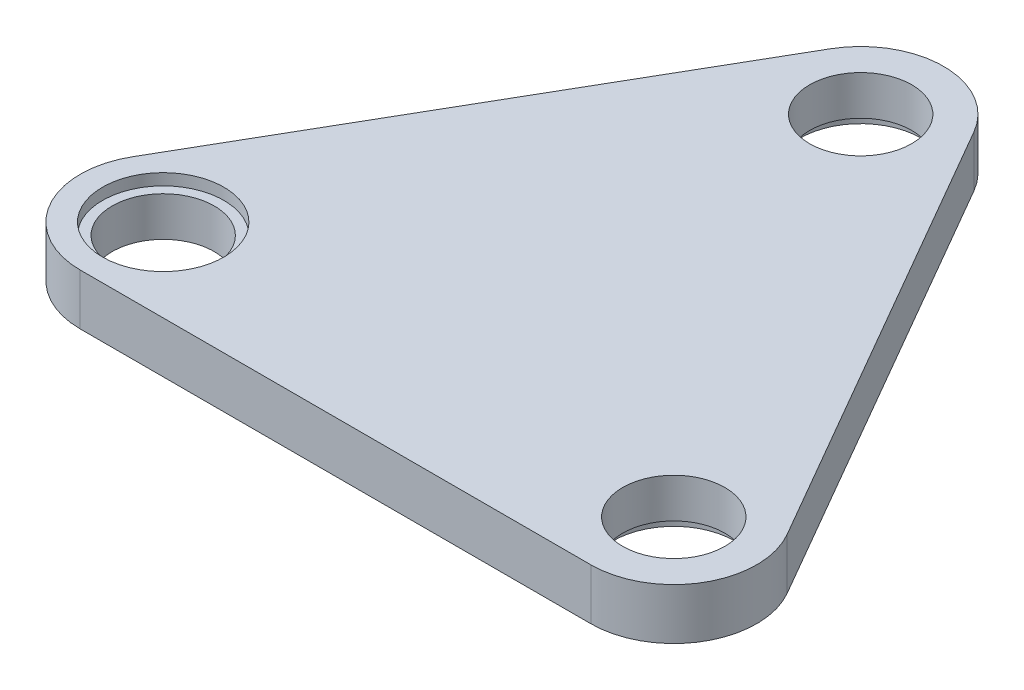
ISO-10303-21;
HEADER;
FILE_DESCRIPTION(('STEP AP214'),'2;1');
FILE_NAME('part.step','',(''),(''),'','','');
FILE_SCHEMA(('AUTOMOTIVE_DESIGN { 1 0 10303 214 1 1 1 1 }'));
ENDSEC;
DATA;
#1=APPLICATION_CONTEXT('core data for automotive mechanical design processes');
#2=APPLICATION_PROTOCOL_DEFINITION('international standard','automotive_design',2000,#1);
#3=PRODUCT_CONTEXT('',#1,'mechanical');
#4=PRODUCT('Part','Part','',(#3));
#5=PRODUCT_RELATED_PRODUCT_CATEGORY('part','',(#4));
#6=PRODUCT_DEFINITION_FORMATION('','',#4);
#7=PRODUCT_DEFINITION_CONTEXT('part definition',#1,'design');
#8=PRODUCT_DEFINITION('design','',#6,#7);
#9=PRODUCT_DEFINITION_SHAPE('','',#8);
#10=(LENGTH_UNIT() NAMED_UNIT(*) SI_UNIT(.MILLI.,.METRE.));
#11=(NAMED_UNIT(*) PLANE_ANGLE_UNIT() SI_UNIT($,.RADIAN.));
#12=(NAMED_UNIT(*) SI_UNIT($,.STERADIAN.) SOLID_ANGLE_UNIT());
#13=UNCERTAINTY_MEASURE_WITH_UNIT(LENGTH_MEASURE(1.E-05),#10,'distance_accuracy_value','');
#14=(GEOMETRIC_REPRESENTATION_CONTEXT(3) GLOBAL_UNCERTAINTY_ASSIGNED_CONTEXT((#13)) GLOBAL_UNIT_ASSIGNED_CONTEXT((#10,
#11,#12)) REPRESENTATION_CONTEXT('',''));
#15=CARTESIAN_POINT('',(0.,0.,0.));
#16=DIRECTION('',(0.,0.,1.));
#17=DIRECTION('',(1.,0.,0.));
#18=AXIS2_PLACEMENT_3D('',#15,#16,#17);
#19=CARTESIAN_POINT('',(-5.62916512459886,4.,-3.24999999999999));
#20=DIRECTION('',(-0.86602540378444,0.,-0.499999999999998));
#21=DIRECTION('',(-0.499999999999998,0.,0.86602540378444));
#22=AXIS2_PLACEMENT_3D('',#19,#20,#21);
#23=PLANE('',#22);
#24=DIRECTION('',(0.499999999999998,0.,-0.86602540378444));
#25=VECTOR('',#24,1.);
#26=CARTESIAN_POINT('',(-5.62916512459886,0.,-3.24999999999999));
#27=LINE('',#26,#25);
#28=CARTESIAN_POINT('',(-5.62916512459886,0.,-3.24999999999999));
#29=VERTEX_POINT('',#28);
#30=CARTESIAN_POINT('',(14.370834875401,0.,-37.8910161513776));
#31=VERTEX_POINT('',#30);
#32=EDGE_CURVE('E127',#29,#31,#27,.T.);
#33=ORIENTED_EDGE('',*,*,#32,.F.);
#34=DIRECTION('',(0.,-1.,0.));
#35=VECTOR('',#34,1.);
#36=CARTESIAN_POINT('',(-5.62916512459886,4.,-3.24999999999999));
#37=LINE('',#36,#35);
#38=CARTESIAN_POINT('',(-5.62916512459886,4.,-3.24999999999999));
#39=VERTEX_POINT('',#38);
#40=EDGE_CURVE('E11',#39,#29,#37,.T.);
#41=ORIENTED_EDGE('',*,*,#40,.F.);
#42=DIRECTION('',(0.499999999999998,0.,-0.86602540378444));
#43=VECTOR('',#42,1.);
#44=CARTESIAN_POINT('',(-5.62916512459886,4.,-3.24999999999999));
#45=LINE('',#44,#43);
#46=CARTESIAN_POINT('',(14.370834875401,4.,-37.8910161513776));
#47=VERTEX_POINT('',#46);
#48=EDGE_CURVE('E140',#39,#47,#45,.T.);
#49=ORIENTED_EDGE('',*,*,#48,.T.);
#50=DIRECTION('',(0.,-1.,0.));
#51=VECTOR('',#50,1.);
#52=CARTESIAN_POINT('',(14.370834875401,4.,-37.8910161513776));
#53=LINE('',#52,#51);
#54=EDGE_CURVE('E89',#47,#31,#53,.T.);
#55=ORIENTED_EDGE('',*,*,#54,.T.);
#56=EDGE_LOOP('',(#33,#41,#49,#55));
#57=FACE_BOUND('',#56,.T.);
#58=ADVANCED_FACE('F43',(#57),#23,.T.);
#59=CARTESIAN_POINT('',(0.,4.,0.));
#60=DIRECTION('',(0.,-1.,0.));
#61=DIRECTION('',(0.,0.,-1.));
#62=AXIS2_PLACEMENT_3D('',#59,#60,#61);
#63=CYLINDRICAL_SURFACE('',#62,6.5);
#64=CARTESIAN_POINT('',(0.,0.,0.));
#65=DIRECTION('',(0.,1.,0.));
#66=DIRECTION('',(0.,0.,1.));
#67=AXIS2_PLACEMENT_3D('',#64,#65,#66);
#68=CIRCLE('',#67,6.5);
#69=CARTESIAN_POINT('',(0.,0.,6.5));
#70=VERTEX_POINT('',#69);
#71=EDGE_CURVE('E130',#29,#70,#68,.T.);
#72=ORIENTED_EDGE('',*,*,#71,.T.);
#73=DIRECTION('',(0.,-1.,0.));
#74=VECTOR('',#73,1.);
#75=CARTESIAN_POINT('',(0.,4.,6.5));
#76=LINE('',#75,#74);
#77=CARTESIAN_POINT('',(0.,4.,6.5));
#78=VERTEX_POINT('',#77);
#79=EDGE_CURVE('E52',#78,#70,#76,.T.);
#80=ORIENTED_EDGE('',*,*,#79,.F.);
#81=CARTESIAN_POINT('',(0.,4.,0.));
#82=DIRECTION('',(0.,1.,0.));
#83=DIRECTION('',(0.,0.,1.));
#84=AXIS2_PLACEMENT_3D('',#81,#82,#83);
#85=CIRCLE('',#84,6.5);
#86=EDGE_CURVE('E172',#39,#78,#85,.T.);
#87=ORIENTED_EDGE('',*,*,#86,.F.);
#88=ORIENTED_EDGE('',*,*,#40,.T.);
#89=EDGE_LOOP('',(#72,#80,#87,#88));
#90=FACE_BOUND('',#89,.T.);
#91=ADVANCED_FACE('F175',(#90),#63,.T.);
#92=CARTESIAN_POINT('',(0.,4.,6.5));
#93=DIRECTION('',(0.,0.,-1.));
#94=DIRECTION('',(-1.,0.,0.));
#95=AXIS2_PLACEMENT_3D('',#92,#93,#94);
#96=PLANE('',#95);
#97=DIRECTION('',(1.,0.,0.));
#98=VECTOR('',#97,1.);
#99=CARTESIAN_POINT('',(0.,0.,6.5));
#100=LINE('',#99,#98);
#101=CARTESIAN_POINT('',(40.,0.,6.5));
#102=VERTEX_POINT('',#101);
#103=EDGE_CURVE('E133',#70,#102,#100,.T.);
#104=ORIENTED_EDGE('',*,*,#103,.T.);
#105=DIRECTION('',(0.,-1.,0.));
#106=VECTOR('',#105,1.);
#107=CARTESIAN_POINT('',(40.,4.,6.5));
#108=LINE('',#107,#106);
#109=CARTESIAN_POINT('',(40.,4.,6.5));
#110=VERTEX_POINT('',#109);
#111=EDGE_CURVE('E120',#110,#102,#108,.T.);
#112=ORIENTED_EDGE('',*,*,#111,.F.);
#113=DIRECTION('',(1.,0.,0.));
#114=VECTOR('',#113,1.);
#115=CARTESIAN_POINT('',(0.,4.,6.5));
#116=LINE('',#115,#114);
#117=EDGE_CURVE('E107',#78,#110,#116,.T.);
#118=ORIENTED_EDGE('',*,*,#117,.F.);
#119=ORIENTED_EDGE('',*,*,#79,.T.);
#120=EDGE_LOOP('',(#104,#112,#118,#119));
#121=FACE_BOUND('',#120,.T.);
#122=ADVANCED_FACE('F179',(#121),#96,.F.);
#123=CARTESIAN_POINT('',(40.,4.,0.));
#124=DIRECTION('',(0.,-1.,0.));
#125=DIRECTION('',(0.,0.,-1.));
#126=AXIS2_PLACEMENT_3D('',#123,#124,#125);
#127=CYLINDRICAL_SURFACE('',#126,6.5);
#128=CARTESIAN_POINT('',(40.,0.,0.));
#129=DIRECTION('',(0.,1.,0.));
#130=DIRECTION('',(0.,0.,1.));
#131=AXIS2_PLACEMENT_3D('',#128,#129,#130);
#132=CIRCLE('',#131,6.5);
#133=CARTESIAN_POINT('',(45.6291651245988,0.,-3.25000000000001));
#134=VERTEX_POINT('',#133);
#135=EDGE_CURVE('E116',#102,#134,#132,.T.);
#136=ORIENTED_EDGE('',*,*,#135,.T.);
#137=DIRECTION('',(0.,-1.,0.));
#138=VECTOR('',#137,1.);
#139=CARTESIAN_POINT('',(45.6291651245988,4.,-3.25000000000001));
#140=LINE('',#139,#138);
#141=CARTESIAN_POINT('',(45.6291651245988,4.,-3.25000000000001));
#142=VERTEX_POINT('',#141);
#143=EDGE_CURVE('E113',#142,#134,#140,.T.);
#144=ORIENTED_EDGE('',*,*,#143,.F.);
#145=CARTESIAN_POINT('',(40.,4.,0.));
#146=DIRECTION('',(0.,1.,0.));
#147=DIRECTION('',(0.,0.,1.));
#148=AXIS2_PLACEMENT_3D('',#145,#146,#147);
#149=CIRCLE('',#148,6.5);
#150=EDGE_CURVE('E101',#110,#142,#149,.T.);
#151=ORIENTED_EDGE('',*,*,#150,.F.);
#152=ORIENTED_EDGE('',*,*,#111,.T.);
#153=EDGE_LOOP('',(#136,#144,#151,#152));
#154=FACE_BOUND('',#153,.T.);
#155=ADVANCED_FACE('F114',(#154),#127,.T.);
#156=CARTESIAN_POINT('',(35.6291651245988,4.,-20.5705080756888));
#157=DIRECTION('',(0.866025403784438,0.,-0.500000000000001));
#158=DIRECTION('',(-0.500000000000001,0.,-0.866025403784438));
#159=AXIS2_PLACEMENT_3D('',#156,#157,#158);
#160=PLANE('',#159);
#161=DIRECTION('',(0.500000000000001,0.,0.866025403784438));
#162=VECTOR('',#161,1.);
#163=CARTESIAN_POINT('',(35.6291651245988,0.,-20.5705080756888));
#164=LINE('',#163,#162);
#165=CARTESIAN_POINT('',(25.6291651245988,0.,-37.8910161513776));
#166=VERTEX_POINT('',#165);
#167=EDGE_CURVE('E136',#166,#134,#164,.T.);
#168=ORIENTED_EDGE('',*,*,#167,.F.);
#169=DIRECTION('',(0.,-1.,0.));
#170=VECTOR('',#169,1.);
#171=CARTESIAN_POINT('',(25.6291651245988,4.,-37.8910161513776));
#172=LINE('',#171,#170);
#173=CARTESIAN_POINT('',(25.6291651245988,4.,-37.8910161513776));
#174=VERTEX_POINT('',#173);
#175=EDGE_CURVE('E82',#174,#166,#172,.T.);
#176=ORIENTED_EDGE('',*,*,#175,.F.);
#177=DIRECTION('',(0.500000000000001,0.,0.866025403784438));
#178=VECTOR('',#177,1.);
#179=CARTESIAN_POINT('',(35.6291651245988,4.,-20.5705080756888));
#180=LINE('',#179,#178);
#181=EDGE_CURVE('E105',#174,#142,#180,.T.);
#182=ORIENTED_EDGE('',*,*,#181,.T.);
#183=ORIENTED_EDGE('',*,*,#143,.T.);
#184=EDGE_LOOP('',(#168,#176,#182,#183));
#185=FACE_BOUND('',#184,.T.);
#186=ADVANCED_FACE('F122',(#185),#160,.T.);
#187=CARTESIAN_POINT('',(19.9999999999999,4.,-34.6410161513776));
#188=DIRECTION('',(0.,-1.,0.));
#189=DIRECTION('',(0.,0.,-1.));
#190=AXIS2_PLACEMENT_3D('',#187,#188,#189);
#191=CYLINDRICAL_SURFACE('',#190,6.50000000000001);
#192=CARTESIAN_POINT('',(19.9999999999999,0.,-34.6410161513776));
#193=DIRECTION('',(0.,1.,0.));
#194=DIRECTION('',(0.,0.,1.));
#195=AXIS2_PLACEMENT_3D('',#192,#193,#194);
#196=CIRCLE('',#195,6.50000000000001);
#197=EDGE_CURVE('E138',#166,#31,#196,.T.);
#198=ORIENTED_EDGE('',*,*,#197,.T.);
#199=ORIENTED_EDGE('',*,*,#54,.F.);
#200=CARTESIAN_POINT('',(19.9999999999999,4.,-34.6410161513776));
#201=DIRECTION('',(0.,1.,0.));
#202=DIRECTION('',(0.,0.,1.));
#203=AXIS2_PLACEMENT_3D('',#200,#201,#202);
#204=CIRCLE('',#203,6.50000000000001);
#205=EDGE_CURVE('E61',#174,#47,#204,.T.);
#206=ORIENTED_EDGE('',*,*,#205,.F.);
#207=ORIENTED_EDGE('',*,*,#175,.T.);
#208=EDGE_LOOP('',(#198,#199,#206,#207));
#209=FACE_BOUND('',#208,.T.);
#210=ADVANCED_FACE('F182',(#209),#191,.T.);
#211=CARTESIAN_POINT('',(0.,4.,0.));
#212=DIRECTION('',(0.,1.,0.));
#213=DIRECTION('',(0.,0.,1.));
#214=AXIS2_PLACEMENT_3D('',#211,#212,#213);
#215=PLANE('',#214);
#216=CARTESIAN_POINT('',(40.,4.,0.));
#217=DIRECTION('',(0.,1.,0.));
#218=DIRECTION('',(0.,0.,1.));
#219=AXIS2_PLACEMENT_3D('',#216,#217,#218);
#220=CIRCLE('',#219,4.);
#221=CARTESIAN_POINT('',(40.,4.,4.));
#222=VERTEX_POINT('',#221);
#223=EDGE_CURVE('E46',#222,#222,#220,.T.);
#224=ORIENTED_EDGE('',*,*,#223,.F.);
#225=EDGE_LOOP('',(#224));
#226=FACE_BOUND('',#225,.T.);
#227=CARTESIAN_POINT('',(19.9999999999999,4.,-34.6410161513776));
#228=DIRECTION('',(0.,1.,0.));
#229=DIRECTION('',(0.,0.,1.));
#230=AXIS2_PLACEMENT_3D('',#227,#228,#229);
#231=CIRCLE('',#230,4.);
#232=CARTESIAN_POINT('',(19.9999999999999,4.,-30.6410161513776));
#233=VERTEX_POINT('',#232);
#234=EDGE_CURVE('E148',#233,#233,#231,.T.);
#235=ORIENTED_EDGE('',*,*,#234,.F.);
#236=EDGE_LOOP('',(#235));
#237=FACE_BOUND('',#236,.T.);
#238=CARTESIAN_POINT('',(0.,4.,0.));
#239=DIRECTION('',(0.,1.,0.));
#240=DIRECTION('',(0.,0.,1.));
#241=AXIS2_PLACEMENT_3D('',#238,#239,#240);
#242=CIRCLE('',#241,4.75);
#243=CARTESIAN_POINT('',(0.,4.,4.75));
#244=VERTEX_POINT('',#243);
#245=EDGE_CURVE('E150',#244,#244,#242,.T.);
#246=ORIENTED_EDGE('',*,*,#245,.F.);
#247=EDGE_LOOP('',(#246));
#248=FACE_BOUND('',#247,.T.);
#249=ORIENTED_EDGE('',*,*,#48,.F.);
#250=ORIENTED_EDGE('',*,*,#86,.T.);
#251=ORIENTED_EDGE('',*,*,#117,.T.);
#252=ORIENTED_EDGE('',*,*,#150,.T.);
#253=ORIENTED_EDGE('',*,*,#181,.F.);
#254=ORIENTED_EDGE('',*,*,#205,.T.);
#255=EDGE_LOOP('',(#249,#250,#251,#252,#253,#254));
#256=FACE_BOUND('',#255,.T.);
#257=ADVANCED_FACE('F103',(#226,#237,#248,#256),#215,.T.);
#258=CARTESIAN_POINT('',(0.,0.,0.));
#259=DIRECTION('',(0.,1.,0.));
#260=DIRECTION('',(0.,0.,1.));
#261=AXIS2_PLACEMENT_3D('',#258,#259,#260);
#262=PLANE('',#261);
#263=CARTESIAN_POINT('',(40.,0.,0.));
#264=DIRECTION('',(0.,-1.,0.));
#265=DIRECTION('',(0.,0.,-1.));
#266=AXIS2_PLACEMENT_3D('',#263,#264,#265);
#267=CIRCLE('',#266,4.75);
#268=CARTESIAN_POINT('',(40.,0.,-4.75));
#269=VERTEX_POINT('',#268);
#270=EDGE_CURVE('E246',#269,#269,#267,.T.);
#271=ORIENTED_EDGE('',*,*,#270,.F.);
#272=EDGE_LOOP('',(#271));
#273=FACE_BOUND('',#272,.T.);
#274=CARTESIAN_POINT('',(19.9999999999999,0.,-34.6410161513776));
#275=DIRECTION('',(0.,-1.,0.));
#276=DIRECTION('',(0.,0.,-1.));
#277=AXIS2_PLACEMENT_3D('',#274,#275,#276);
#278=CIRCLE('',#277,4.74999999999999);
#279=CARTESIAN_POINT('',(19.9999999999999,0.,-39.3910161513776));
#280=VERTEX_POINT('',#279);
#281=EDGE_CURVE('E163',#280,#280,#278,.T.);
#282=ORIENTED_EDGE('',*,*,#281,.F.);
#283=EDGE_LOOP('',(#282));
#284=FACE_BOUND('',#283,.T.);
#285=CARTESIAN_POINT('',(0.,0.,0.));
#286=DIRECTION('',(0.,1.,0.));
#287=DIRECTION('',(0.,0.,1.));
#288=AXIS2_PLACEMENT_3D('',#285,#286,#287);
#289=CIRCLE('',#288,4.);
#290=CARTESIAN_POINT('',(0.,0.,4.));
#291=VERTEX_POINT('',#290);
#292=EDGE_CURVE('E131',#291,#291,#289,.T.);
#293=ORIENTED_EDGE('',*,*,#292,.T.);
#294=EDGE_LOOP('',(#293));
#295=FACE_BOUND('',#294,.T.);
#296=ORIENTED_EDGE('',*,*,#32,.T.);
#297=ORIENTED_EDGE('',*,*,#197,.F.);
#298=ORIENTED_EDGE('',*,*,#167,.T.);
#299=ORIENTED_EDGE('',*,*,#135,.F.);
#300=ORIENTED_EDGE('',*,*,#103,.F.);
#301=ORIENTED_EDGE('',*,*,#71,.F.);
#302=EDGE_LOOP('',(#296,#297,#298,#299,#300,#301));
#303=FACE_BOUND('',#302,.T.);
#304=ADVANCED_FACE('F181',(#273,#284,#295,#303),#262,.F.);
#305=CARTESIAN_POINT('',(0.,4.,0.));
#306=DIRECTION('',(0.,1.,0.));
#307=DIRECTION('',(0.,0.,1.));
#308=AXIS2_PLACEMENT_3D('',#305,#306,#307);
#309=CYLINDRICAL_SURFACE('',#308,4.);
#310=CARTESIAN_POINT('',(0.,3.1,0.));
#311=DIRECTION('',(0.,1.,0.));
#312=DIRECTION('',(0.,0.,1.));
#313=AXIS2_PLACEMENT_3D('',#310,#311,#312);
#314=CIRCLE('',#313,4.);
#315=CARTESIAN_POINT('',(0.,3.1,4.));
#316=VERTEX_POINT('',#315);
#317=EDGE_CURVE('E147',#316,#316,#314,.T.);
#318=ORIENTED_EDGE('',*,*,#317,.T.);
#319=EDGE_LOOP('',(#318));
#320=FACE_BOUND('',#319,.T.);
#321=ORIENTED_EDGE('',*,*,#292,.F.);
#322=EDGE_LOOP('',(#321));
#323=FACE_BOUND('',#322,.T.);
#324=ADVANCED_FACE('F200',(#320,#323),#309,.F.);
#325=CARTESIAN_POINT('',(4.,3.1,0.));
#326=DIRECTION('',(0.,-1.,0.));
#327=DIRECTION('',(0.,0.,-1.));
#328=AXIS2_PLACEMENT_3D('',#325,#326,#327);
#329=PLANE('',#328);
#330=ORIENTED_EDGE('',*,*,#317,.F.);
#331=EDGE_LOOP('',(#330));
#332=FACE_BOUND('',#331,.T.);
#333=CARTESIAN_POINT('',(0.,3.1,0.));
#334=DIRECTION('',(0.,1.,0.));
#335=DIRECTION('',(0.,0.,1.));
#336=AXIS2_PLACEMENT_3D('',#333,#334,#335);
#337=CIRCLE('',#336,4.75);
#338=CARTESIAN_POINT('',(0.,3.1,4.75));
#339=VERTEX_POINT('',#338);
#340=EDGE_CURVE('E155',#339,#339,#337,.T.);
#341=ORIENTED_EDGE('',*,*,#340,.T.);
#342=EDGE_LOOP('',(#341));
#343=FACE_BOUND('',#342,.T.);
#344=ADVANCED_FACE('F207',(#332,#343),#329,.F.);
#345=CARTESIAN_POINT('',(0.,4.,0.));
#346=DIRECTION('',(0.,1.,0.));
#347=DIRECTION('',(0.,0.,1.));
#348=AXIS2_PLACEMENT_3D('',#345,#346,#347);
#349=CYLINDRICAL_SURFACE('',#348,4.75);
#350=ORIENTED_EDGE('',*,*,#340,.F.);
#351=EDGE_LOOP('',(#350));
#352=FACE_BOUND('',#351,.T.);
#353=ORIENTED_EDGE('',*,*,#245,.T.);
#354=EDGE_LOOP('',(#353));
#355=FACE_BOUND('',#354,.T.);
#356=ADVANCED_FACE('F211',(#352,#355),#349,.F.);
#357=CARTESIAN_POINT('',(19.9999999999999,0.,-34.6410161513776));
#358=DIRECTION('',(0.,-1.,0.));
#359=DIRECTION('',(0.,0.,-1.));
#360=AXIS2_PLACEMENT_3D('',#357,#358,#359);
#361=CYLINDRICAL_SURFACE('',#360,4.);
#362=ORIENTED_EDGE('',*,*,#234,.T.);
#363=EDGE_LOOP('',(#362));
#364=FACE_BOUND('',#363,.T.);
#365=CARTESIAN_POINT('',(19.9999999999999,0.899999999999998,-34.6410161513776));
#366=DIRECTION('',(0.,-1.,0.));
#367=DIRECTION('',(0.,0.,-1.));
#368=AXIS2_PLACEMENT_3D('',#365,#366,#367);
#369=CIRCLE('',#368,4.);
#370=CARTESIAN_POINT('',(19.9999999999999,0.899999999999998,-38.6410161513776));
#371=VERTEX_POINT('',#370);
#372=EDGE_CURVE('E151',#371,#371,#369,.T.);
#373=ORIENTED_EDGE('',*,*,#372,.T.);
#374=EDGE_LOOP('',(#373));
#375=FACE_BOUND('',#374,.T.);
#376=ADVANCED_FACE('F215',(#364,#375),#361,.F.);
#377=CARTESIAN_POINT('',(23.9999999999999,0.9,-34.6410161513776));
#378=DIRECTION('',(0.,1.,0.));
#379=DIRECTION('',(0.,0.,1.));
#380=AXIS2_PLACEMENT_3D('',#377,#378,#379);
#381=PLANE('',#380);
#382=ORIENTED_EDGE('',*,*,#372,.F.);
#383=EDGE_LOOP('',(#382));
#384=FACE_BOUND('',#383,.T.);
#385=CARTESIAN_POINT('',(19.9999999999999,0.900000000000001,-34.6410161513776));
#386=DIRECTION('',(0.,-1.,0.));
#387=DIRECTION('',(0.,0.,-1.));
#388=AXIS2_PLACEMENT_3D('',#385,#386,#387);
#389=CIRCLE('',#388,4.74999999999999);
#390=CARTESIAN_POINT('',(19.9999999999999,0.900000000000001,-39.3910161513776));
#391=VERTEX_POINT('',#390);
#392=EDGE_CURVE('E158',#391,#391,#389,.T.);
#393=ORIENTED_EDGE('',*,*,#392,.T.);
#394=EDGE_LOOP('',(#393));
#395=FACE_BOUND('',#394,.T.);
#396=ADVANCED_FACE('F219',(#384,#395),#381,.F.);
#397=CARTESIAN_POINT('',(19.9999999999999,0.,-34.6410161513776));
#398=DIRECTION('',(0.,-1.,0.));
#399=DIRECTION('',(0.,0.,-1.));
#400=AXIS2_PLACEMENT_3D('',#397,#398,#399);
#401=CYLINDRICAL_SURFACE('',#400,4.74999999999999);
#402=ORIENTED_EDGE('',*,*,#392,.F.);
#403=EDGE_LOOP('',(#402));
#404=FACE_BOUND('',#403,.T.);
#405=ORIENTED_EDGE('',*,*,#281,.T.);
#406=EDGE_LOOP('',(#405));
#407=FACE_BOUND('',#406,.T.);
#408=ADVANCED_FACE('F222',(#404,#407),#401,.F.);
#409=CARTESIAN_POINT('',(40.,0.,0.));
#410=DIRECTION('',(0.,-1.,0.));
#411=DIRECTION('',(0.,0.,-1.));
#412=AXIS2_PLACEMENT_3D('',#409,#410,#411);
#413=CYLINDRICAL_SURFACE('',#412,4.);
#414=ORIENTED_EDGE('',*,*,#223,.T.);
#415=EDGE_LOOP('',(#414));
#416=FACE_BOUND('',#415,.T.);
#417=CARTESIAN_POINT('',(40.,0.899999999999998,0.));
#418=DIRECTION('',(0.,-1.,0.));
#419=DIRECTION('',(0.,0.,-1.));
#420=AXIS2_PLACEMENT_3D('',#417,#418,#419);
#421=CIRCLE('',#420,4.);
#422=CARTESIAN_POINT('',(40.,0.899999999999998,-4.00000000000001));
#423=VERTEX_POINT('',#422);
#424=EDGE_CURVE('E248',#423,#423,#421,.T.);
#425=ORIENTED_EDGE('',*,*,#424,.T.);
#426=EDGE_LOOP('',(#425));
#427=FACE_BOUND('',#426,.T.);
#428=ADVANCED_FACE('F226',(#416,#427),#413,.F.);
#429=CARTESIAN_POINT('',(44.,0.9,0.));
#430=DIRECTION('',(0.,1.,0.));
#431=DIRECTION('',(0.,0.,1.));
#432=AXIS2_PLACEMENT_3D('',#429,#430,#431);
#433=PLANE('',#432);
#434=ORIENTED_EDGE('',*,*,#424,.F.);
#435=EDGE_LOOP('',(#434));
#436=FACE_BOUND('',#435,.T.);
#437=CARTESIAN_POINT('',(40.,0.900000000000001,0.));
#438=DIRECTION('',(0.,-1.,0.));
#439=DIRECTION('',(0.,0.,-1.));
#440=AXIS2_PLACEMENT_3D('',#437,#438,#439);
#441=CIRCLE('',#440,4.75);
#442=CARTESIAN_POINT('',(40.,0.900000000000001,-4.75));
#443=VERTEX_POINT('',#442);
#444=EDGE_CURVE('E243',#443,#443,#441,.T.);
#445=ORIENTED_EDGE('',*,*,#444,.T.);
#446=EDGE_LOOP('',(#445));
#447=FACE_BOUND('',#446,.T.);
#448=ADVANCED_FACE('F230',(#436,#447),#433,.F.);
#449=CARTESIAN_POINT('',(40.,0.,0.));
#450=DIRECTION('',(0.,-1.,0.));
#451=DIRECTION('',(0.,0.,-1.));
#452=AXIS2_PLACEMENT_3D('',#449,#450,#451);
#453=CYLINDRICAL_SURFACE('',#452,4.75);
#454=ORIENTED_EDGE('',*,*,#444,.F.);
#455=EDGE_LOOP('',(#454));
#456=FACE_BOUND('',#455,.T.);
#457=ORIENTED_EDGE('',*,*,#270,.T.);
#458=EDGE_LOOP('',(#457));
#459=FACE_BOUND('',#458,.T.);
#460=ADVANCED_FACE('F234',(#456,#459),#453,.F.);
#461=CLOSED_SHELL('',(#58,#91,#122,#155,#186,#210,#257,#304,#324,#344,#356,#376,#396,#408,#428,
#448,#460));
#462=MANIFOLD_SOLID_BREP('B2',#461);
#463=ADVANCED_BREP_SHAPE_REPRESENTATION('',(#18,#462),#14);
#464=SHAPE_DEFINITION_REPRESENTATION(#9,#463);
ENDSEC;
END-ISO-10303-21;
